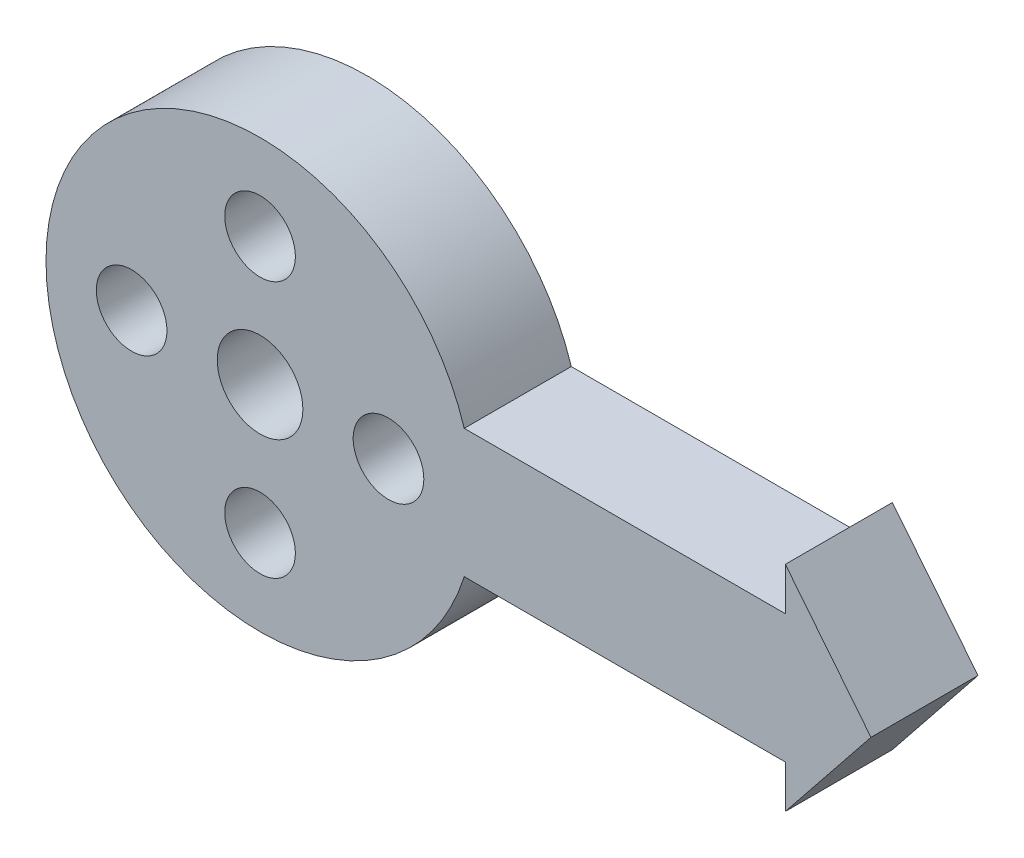
ISO-10303-21;
HEADER;
FILE_DESCRIPTION(('STEP AP214'),'2;1');
FILE_NAME('part.step','',(''),(''),'','','');
FILE_SCHEMA(('AUTOMOTIVE_DESIGN { 1 0 10303 214 1 1 1 1 }'));
ENDSEC;
DATA;
#1=APPLICATION_CONTEXT('core data for automotive mechanical design processes');
#2=APPLICATION_PROTOCOL_DEFINITION('international standard','automotive_design',2000,#1);
#3=PRODUCT_CONTEXT('',#1,'mechanical');
#4=PRODUCT('Part','Part','',(#3));
#5=PRODUCT_RELATED_PRODUCT_CATEGORY('part','',(#4));
#6=PRODUCT_DEFINITION_FORMATION('','',#4);
#7=PRODUCT_DEFINITION_CONTEXT('part definition',#1,'design');
#8=PRODUCT_DEFINITION('design','',#6,#7);
#9=PRODUCT_DEFINITION_SHAPE('','',#8);
#10=(LENGTH_UNIT() NAMED_UNIT(*) SI_UNIT(.MILLI.,.METRE.));
#11=(NAMED_UNIT(*) PLANE_ANGLE_UNIT() SI_UNIT($,.RADIAN.));
#12=(NAMED_UNIT(*) SI_UNIT($,.STERADIAN.) SOLID_ANGLE_UNIT());
#13=UNCERTAINTY_MEASURE_WITH_UNIT(LENGTH_MEASURE(1.E-05),#10,'distance_accuracy_value','');
#14=(GEOMETRIC_REPRESENTATION_CONTEXT(3) GLOBAL_UNCERTAINTY_ASSIGNED_CONTEXT((#13)) GLOBAL_UNIT_ASSIGNED_CONTEXT((#10,
#11,#12)) REPRESENTATION_CONTEXT('',''));
#15=CARTESIAN_POINT('',(0.,0.,0.));
#16=DIRECTION('',(0.,0.,1.));
#17=DIRECTION('',(1.,0.,0.));
#18=AXIS2_PLACEMENT_3D('',#15,#16,#17);
#19=CARTESIAN_POINT('',(0.,0.,5.));
#20=DIRECTION('',(0.,0.,1.));
#21=DIRECTION('',(1.,0.,0.));
#22=AXIS2_PLACEMENT_3D('',#19,#20,#21);
#23=PLANE('',#22);
#24=CARTESIAN_POINT('',(0.,-6.,5.));
#25=DIRECTION('',(0.,0.,1.));
#26=DIRECTION('',(1.,0.,0.));
#27=AXIS2_PLACEMENT_3D('',#24,#25,#26);
#28=CIRCLE('',#27,1.65);
#29=CARTESIAN_POINT('',(1.65,-6.,5.));
#30=VERTEX_POINT('',#29);
#31=EDGE_CURVE('E182',#30,#30,#28,.T.);
#32=ORIENTED_EDGE('',*,*,#31,.F.);
#33=EDGE_LOOP('',(#32));
#34=FACE_BOUND('',#33,.T.);
#35=CARTESIAN_POINT('',(0.,6.,5.));
#36=DIRECTION('',(0.,0.,1.));
#37=DIRECTION('',(1.,0.,0.));
#38=AXIS2_PLACEMENT_3D('',#35,#36,#37);
#39=CIRCLE('',#38,1.65);
#40=CARTESIAN_POINT('',(1.65,6.,5.));
#41=VERTEX_POINT('',#40);
#42=EDGE_CURVE('E170',#41,#41,#39,.T.);
#43=ORIENTED_EDGE('',*,*,#42,.F.);
#44=EDGE_LOOP('',(#43));
#45=FACE_BOUND('',#44,.T.);
#46=DIRECTION('',(-0.624695047554424,0.78086880944303,0.));
#47=VECTOR('',#46,1.);
#48=CARTESIAN_POINT('',(24.5393920141695,5.,5.));
#49=LINE('',#48,#47);
#50=CARTESIAN_POINT('',(28.5393920141695,0.,5.));
#51=VERTEX_POINT('',#50);
#52=CARTESIAN_POINT('',(24.5393920141695,5.,5.));
#53=VERTEX_POINT('',#52);
#54=EDGE_CURVE('E143',#51,#53,#49,.T.);
#55=ORIENTED_EDGE('',*,*,#54,.T.);
#56=DIRECTION('',(0.,-1.,0.));
#57=VECTOR('',#56,1.);
#58=CARTESIAN_POINT('',(24.5393920141695,3.,5.));
#59=LINE('',#58,#57);
#60=CARTESIAN_POINT('',(24.5393920141695,3.,5.));
#61=VERTEX_POINT('',#60);
#62=EDGE_CURVE('E96',#53,#61,#59,.T.);
#63=ORIENTED_EDGE('',*,*,#62,.T.);
#64=DIRECTION('',(-1.,0.,0.));
#65=VECTOR('',#64,1.);
#66=CARTESIAN_POINT('',(9.53939201416946,3.,5.));
#67=LINE('',#66,#65);
#68=CARTESIAN_POINT('',(9.53939201416946,3.,5.));
#69=VERTEX_POINT('',#68);
#70=EDGE_CURVE('E155',#61,#69,#67,.T.);
#71=ORIENTED_EDGE('',*,*,#70,.T.);
#72=CARTESIAN_POINT('',(0.,0.,5.));
#73=DIRECTION('',(0.,0.,1.));
#74=DIRECTION('',(1.,0.,0.));
#75=AXIS2_PLACEMENT_3D('',#72,#73,#74);
#76=CIRCLE('',#75,10.);
#77=CARTESIAN_POINT('',(9.53939201416946,-3.,5.));
#78=VERTEX_POINT('',#77);
#79=EDGE_CURVE('E112',#69,#78,#76,.T.);
#80=ORIENTED_EDGE('',*,*,#79,.T.);
#81=DIRECTION('',(1.,0.,0.));
#82=VECTOR('',#81,1.);
#83=CARTESIAN_POINT('',(24.5393920141695,-3.,5.));
#84=LINE('',#83,#82);
#85=CARTESIAN_POINT('',(24.5393920141695,-3.,5.));
#86=VERTEX_POINT('',#85);
#87=EDGE_CURVE('E106',#78,#86,#84,.T.);
#88=ORIENTED_EDGE('',*,*,#87,.T.);
#89=DIRECTION('',(0.,-1.,0.));
#90=VECTOR('',#89,1.);
#91=CARTESIAN_POINT('',(24.5393920141695,-5.,5.));
#92=LINE('',#91,#90);
#93=CARTESIAN_POINT('',(24.5393920141695,-5.,5.));
#94=VERTEX_POINT('',#93);
#95=EDGE_CURVE('E110',#86,#94,#92,.T.);
#96=ORIENTED_EDGE('',*,*,#95,.T.);
#97=DIRECTION('',(0.624695047554424,0.78086880944303,0.));
#98=VECTOR('',#97,1.);
#99=CARTESIAN_POINT('',(28.5393920141695,0.,5.));
#100=LINE('',#99,#98);
#101=EDGE_CURVE('E56',#94,#51,#100,.T.);
#102=ORIENTED_EDGE('',*,*,#101,.T.);
#103=EDGE_LOOP('',(#55,#63,#71,#80,#88,#96,#102));
#104=FACE_BOUND('',#103,.T.);
#105=CARTESIAN_POINT('',(0.,0.,5.));
#106=DIRECTION('',(0.,0.,1.));
#107=DIRECTION('',(1.,0.,0.));
#108=AXIS2_PLACEMENT_3D('',#105,#106,#107);
#109=CIRCLE('',#108,2.);
#110=CARTESIAN_POINT('',(2.,0.,5.));
#111=VERTEX_POINT('',#110);
#112=EDGE_CURVE('E134',#111,#111,#109,.T.);
#113=ORIENTED_EDGE('',*,*,#112,.F.);
#114=EDGE_LOOP('',(#113));
#115=FACE_BOUND('',#114,.T.);
#116=CARTESIAN_POINT('',(6.,0.,5.));
#117=DIRECTION('',(0.,0.,1.));
#118=DIRECTION('',(1.,0.,0.));
#119=AXIS2_PLACEMENT_3D('',#116,#117,#118);
#120=CIRCLE('',#119,1.65);
#121=CARTESIAN_POINT('',(7.65,0.,5.));
#122=VERTEX_POINT('',#121);
#123=EDGE_CURVE('E176',#122,#122,#120,.T.);
#124=ORIENTED_EDGE('',*,*,#123,.F.);
#125=EDGE_LOOP('',(#124));
#126=FACE_BOUND('',#125,.T.);
#127=CARTESIAN_POINT('',(-6.,0.,5.));
#128=DIRECTION('',(0.,0.,1.));
#129=DIRECTION('',(1.,0.,0.));
#130=AXIS2_PLACEMENT_3D('',#127,#128,#129);
#131=CIRCLE('',#130,1.65);
#132=CARTESIAN_POINT('',(-4.35,0.,5.));
#133=VERTEX_POINT('',#132);
#134=EDGE_CURVE('E188',#133,#133,#131,.T.);
#135=ORIENTED_EDGE('',*,*,#134,.F.);
#136=EDGE_LOOP('',(#135));
#137=FACE_BOUND('',#136,.T.);
#138=ADVANCED_FACE('F39',(#34,#45,#104,#115,#126,#137),#23,.T.);
#139=CARTESIAN_POINT('',(0.,0.,0.));
#140=DIRECTION('',(0.,0.,1.));
#141=DIRECTION('',(1.,0.,0.));
#142=AXIS2_PLACEMENT_3D('',#139,#140,#141);
#143=PLANE('',#142);
#144=DIRECTION('',(-0.624695047554424,0.78086880944303,0.));
#145=VECTOR('',#144,1.);
#146=CARTESIAN_POINT('',(24.5393920141695,5.,0.));
#147=LINE('',#146,#145);
#148=CARTESIAN_POINT('',(28.5393920141695,0.,0.));
#149=VERTEX_POINT('',#148);
#150=CARTESIAN_POINT('',(24.5393920141695,5.,0.));
#151=VERTEX_POINT('',#150);
#152=EDGE_CURVE('E130',#149,#151,#147,.T.);
#153=ORIENTED_EDGE('',*,*,#152,.F.);
#154=DIRECTION('',(0.624695047554424,0.78086880944303,0.));
#155=VECTOR('',#154,1.);
#156=CARTESIAN_POINT('',(28.5393920141695,0.,0.));
#157=LINE('',#156,#155);
#158=CARTESIAN_POINT('',(24.5393920141695,-5.,0.));
#159=VERTEX_POINT('',#158);
#160=EDGE_CURVE('E88',#159,#149,#157,.T.);
#161=ORIENTED_EDGE('',*,*,#160,.F.);
#162=DIRECTION('',(0.,-1.,0.));
#163=VECTOR('',#162,1.);
#164=CARTESIAN_POINT('',(24.5393920141695,-5.,0.));
#165=LINE('',#164,#163);
#166=CARTESIAN_POINT('',(24.5393920141695,-3.,0.));
#167=VERTEX_POINT('',#166);
#168=EDGE_CURVE('E82',#167,#159,#165,.T.);
#169=ORIENTED_EDGE('',*,*,#168,.F.);
#170=DIRECTION('',(1.,0.,0.));
#171=VECTOR('',#170,1.);
#172=CARTESIAN_POINT('',(24.5393920141695,-3.,0.));
#173=LINE('',#172,#171);
#174=CARTESIAN_POINT('',(9.53939201416946,-3.,0.));
#175=VERTEX_POINT('',#174);
#176=EDGE_CURVE('E120',#175,#167,#173,.T.);
#177=ORIENTED_EDGE('',*,*,#176,.F.);
#178=CARTESIAN_POINT('',(0.,0.,0.));
#179=DIRECTION('',(0.,0.,1.));
#180=DIRECTION('',(1.,0.,0.));
#181=AXIS2_PLACEMENT_3D('',#178,#179,#180);
#182=CIRCLE('',#181,10.);
#183=CARTESIAN_POINT('',(9.53939201416946,3.,0.));
#184=VERTEX_POINT('',#183);
#185=EDGE_CURVE('E138',#184,#175,#182,.T.);
#186=ORIENTED_EDGE('',*,*,#185,.F.);
#187=DIRECTION('',(-1.,0.,0.));
#188=VECTOR('',#187,1.);
#189=CARTESIAN_POINT('',(9.53939201416946,3.,0.));
#190=LINE('',#189,#188);
#191=CARTESIAN_POINT('',(24.5393920141695,3.,0.));
#192=VERTEX_POINT('',#191);
#193=EDGE_CURVE('E136',#192,#184,#190,.T.);
#194=ORIENTED_EDGE('',*,*,#193,.F.);
#195=DIRECTION('',(0.,-1.,0.));
#196=VECTOR('',#195,1.);
#197=CARTESIAN_POINT('',(24.5393920141695,3.,0.));
#198=LINE('',#197,#196);
#199=EDGE_CURVE('E133',#151,#192,#198,.T.);
#200=ORIENTED_EDGE('',*,*,#199,.F.);
#201=EDGE_LOOP('',(#153,#161,#169,#177,#186,#194,#200));
#202=FACE_BOUND('',#201,.T.);
#203=CARTESIAN_POINT('',(0.,0.,0.));
#204=DIRECTION('',(0.,0.,1.));
#205=DIRECTION('',(1.,0.,0.));
#206=AXIS2_PLACEMENT_3D('',#203,#204,#205);
#207=CIRCLE('',#206,2.);
#208=CARTESIAN_POINT('',(2.,0.,0.));
#209=VERTEX_POINT('',#208);
#210=EDGE_CURVE('E167',#209,#209,#207,.T.);
#211=ORIENTED_EDGE('',*,*,#210,.T.);
#212=EDGE_LOOP('',(#211));
#213=FACE_BOUND('',#212,.T.);
#214=CARTESIAN_POINT('',(0.,6.,0.));
#215=DIRECTION('',(0.,0.,1.));
#216=DIRECTION('',(1.,0.,0.));
#217=AXIS2_PLACEMENT_3D('',#214,#215,#216);
#218=CIRCLE('',#217,1.65);
#219=CARTESIAN_POINT('',(1.65,6.,0.));
#220=VERTEX_POINT('',#219);
#221=EDGE_CURVE('E173',#220,#220,#218,.T.);
#222=ORIENTED_EDGE('',*,*,#221,.T.);
#223=EDGE_LOOP('',(#222));
#224=FACE_BOUND('',#223,.T.);
#225=CARTESIAN_POINT('',(6.,0.,0.));
#226=DIRECTION('',(0.,0.,1.));
#227=DIRECTION('',(1.,0.,0.));
#228=AXIS2_PLACEMENT_3D('',#225,#226,#227);
#229=CIRCLE('',#228,1.65);
#230=CARTESIAN_POINT('',(7.65,0.,0.));
#231=VERTEX_POINT('',#230);
#232=EDGE_CURVE('E179',#231,#231,#229,.T.);
#233=ORIENTED_EDGE('',*,*,#232,.T.);
#234=EDGE_LOOP('',(#233));
#235=FACE_BOUND('',#234,.T.);
#236=CARTESIAN_POINT('',(0.,-6.,0.));
#237=DIRECTION('',(0.,0.,1.));
#238=DIRECTION('',(1.,0.,0.));
#239=AXIS2_PLACEMENT_3D('',#236,#237,#238);
#240=CIRCLE('',#239,1.65);
#241=CARTESIAN_POINT('',(1.65,-6.,0.));
#242=VERTEX_POINT('',#241);
#243=EDGE_CURVE('E185',#242,#242,#240,.T.);
#244=ORIENTED_EDGE('',*,*,#243,.T.);
#245=EDGE_LOOP('',(#244));
#246=FACE_BOUND('',#245,.T.);
#247=CARTESIAN_POINT('',(-6.,0.,0.));
#248=DIRECTION('',(0.,0.,1.));
#249=DIRECTION('',(1.,0.,0.));
#250=AXIS2_PLACEMENT_3D('',#247,#248,#249);
#251=CIRCLE('',#250,1.65);
#252=CARTESIAN_POINT('',(-4.35,0.,0.));
#253=VERTEX_POINT('',#252);
#254=EDGE_CURVE('E191',#253,#253,#251,.T.);
#255=ORIENTED_EDGE('',*,*,#254,.T.);
#256=EDGE_LOOP('',(#255));
#257=FACE_BOUND('',#256,.T.);
#258=ADVANCED_FACE('F159',(#202,#213,#224,#235,#246,#257),#143,.F.);
#259=CARTESIAN_POINT('',(24.5393920141695,5.,5.));
#260=DIRECTION('',(-0.78086880944303,-0.624695047554424,0.));
#261=DIRECTION('',(0.624695047554424,-0.78086880944303,0.));
#262=AXIS2_PLACEMENT_3D('',#259,#260,#261);
#263=PLANE('',#262);
#264=ORIENTED_EDGE('',*,*,#152,.T.);
#265=DIRECTION('',(0.,0.,-1.));
#266=VECTOR('',#265,1.);
#267=CARTESIAN_POINT('',(24.5393920141695,5.,5.));
#268=LINE('',#267,#266);
#269=EDGE_CURVE('E11',#53,#151,#268,.T.);
#270=ORIENTED_EDGE('',*,*,#269,.F.);
#271=ORIENTED_EDGE('',*,*,#54,.F.);
#272=DIRECTION('',(0.,0.,-1.));
#273=VECTOR('',#272,1.);
#274=CARTESIAN_POINT('',(28.5393920141695,0.,5.));
#275=LINE('',#274,#273);
#276=EDGE_CURVE('E126',#51,#149,#275,.T.);
#277=ORIENTED_EDGE('',*,*,#276,.T.);
#278=EDGE_LOOP('',(#264,#270,#271,#277));
#279=FACE_BOUND('',#278,.T.);
#280=ADVANCED_FACE('F41',(#279),#263,.F.);
#281=CARTESIAN_POINT('',(24.5393920141695,3.,5.));
#282=DIRECTION('',(1.,0.,0.));
#283=DIRECTION('',(0.,0.,-1.));
#284=AXIS2_PLACEMENT_3D('',#281,#282,#283);
#285=PLANE('',#284);
#286=ORIENTED_EDGE('',*,*,#199,.T.);
#287=DIRECTION('',(0.,0.,-1.));
#288=VECTOR('',#287,1.);
#289=CARTESIAN_POINT('',(24.5393920141695,3.,5.));
#290=LINE('',#289,#288);
#291=EDGE_CURVE('E48',#61,#192,#290,.T.);
#292=ORIENTED_EDGE('',*,*,#291,.F.);
#293=ORIENTED_EDGE('',*,*,#62,.F.);
#294=ORIENTED_EDGE('',*,*,#269,.T.);
#295=EDGE_LOOP('',(#286,#292,#293,#294));
#296=FACE_BOUND('',#295,.T.);
#297=ADVANCED_FACE('F223',(#296),#285,.F.);
#298=CARTESIAN_POINT('',(9.53939201416946,3.,5.));
#299=DIRECTION('',(0.,-1.,0.));
#300=DIRECTION('',(0.,0.,-1.));
#301=AXIS2_PLACEMENT_3D('',#298,#299,#300);
#302=PLANE('',#301);
#303=ORIENTED_EDGE('',*,*,#193,.T.);
#304=DIRECTION('',(0.,0.,-1.));
#305=VECTOR('',#304,1.);
#306=CARTESIAN_POINT('',(9.53939201416946,3.,5.));
#307=LINE('',#306,#305);
#308=EDGE_CURVE('E147',#69,#184,#307,.T.);
#309=ORIENTED_EDGE('',*,*,#308,.F.);
#310=ORIENTED_EDGE('',*,*,#70,.F.);
#311=ORIENTED_EDGE('',*,*,#291,.T.);
#312=EDGE_LOOP('',(#303,#309,#310,#311));
#313=FACE_BOUND('',#312,.T.);
#314=ADVANCED_FACE('F153',(#313),#302,.F.);
#315=CARTESIAN_POINT('',(0.,0.,5.));
#316=DIRECTION('',(0.,0.,-1.));
#317=DIRECTION('',(-1.,0.,0.));
#318=AXIS2_PLACEMENT_3D('',#315,#316,#317);
#319=CYLINDRICAL_SURFACE('',#318,10.);
#320=ORIENTED_EDGE('',*,*,#185,.T.);
#321=DIRECTION('',(0.,0.,-1.));
#322=VECTOR('',#321,1.);
#323=CARTESIAN_POINT('',(9.53939201416946,-3.,5.));
#324=LINE('',#323,#322);
#325=EDGE_CURVE('E121',#78,#175,#324,.T.);
#326=ORIENTED_EDGE('',*,*,#325,.F.);
#327=ORIENTED_EDGE('',*,*,#79,.F.);
#328=ORIENTED_EDGE('',*,*,#308,.T.);
#329=EDGE_LOOP('',(#320,#326,#327,#328));
#330=FACE_BOUND('',#329,.T.);
#331=ADVANCED_FACE('F162',(#330),#319,.T.);
#332=CARTESIAN_POINT('',(24.5393920141695,-3.,5.));
#333=DIRECTION('',(0.,1.,0.));
#334=DIRECTION('',(-1.,0.,0.));
#335=AXIS2_PLACEMENT_3D('',#332,#333,#334);
#336=PLANE('',#335);
#337=ORIENTED_EDGE('',*,*,#176,.T.);
#338=DIRECTION('',(0.,0.,-1.));
#339=VECTOR('',#338,1.);
#340=CARTESIAN_POINT('',(24.5393920141695,-3.,5.));
#341=LINE('',#340,#339);
#342=EDGE_CURVE('E117',#86,#167,#341,.T.);
#343=ORIENTED_EDGE('',*,*,#342,.F.);
#344=ORIENTED_EDGE('',*,*,#87,.F.);
#345=ORIENTED_EDGE('',*,*,#325,.T.);
#346=EDGE_LOOP('',(#337,#343,#344,#345));
#347=FACE_BOUND('',#346,.T.);
#348=ADVANCED_FACE('F118',(#347),#336,.F.);
#349=CARTESIAN_POINT('',(24.5393920141695,-5.,5.));
#350=DIRECTION('',(1.,0.,0.));
#351=DIRECTION('',(0.,0.,-1.));
#352=AXIS2_PLACEMENT_3D('',#349,#350,#351);
#353=PLANE('',#352);
#354=ORIENTED_EDGE('',*,*,#168,.T.);
#355=DIRECTION('',(0.,0.,-1.));
#356=VECTOR('',#355,1.);
#357=CARTESIAN_POINT('',(24.5393920141695,-5.,5.));
#358=LINE('',#357,#356);
#359=EDGE_CURVE('E122',#94,#159,#358,.T.);
#360=ORIENTED_EDGE('',*,*,#359,.F.);
#361=ORIENTED_EDGE('',*,*,#95,.F.);
#362=ORIENTED_EDGE('',*,*,#342,.T.);
#363=EDGE_LOOP('',(#354,#360,#361,#362));
#364=FACE_BOUND('',#363,.T.);
#365=ADVANCED_FACE('F124',(#364),#353,.F.);
#366=CARTESIAN_POINT('',(28.5393920141695,0.,5.));
#367=DIRECTION('',(-0.78086880944303,0.624695047554424,0.));
#368=DIRECTION('',(-0.624695047554424,-0.78086880944303,0.));
#369=AXIS2_PLACEMENT_3D('',#366,#367,#368);
#370=PLANE('',#369);
#371=ORIENTED_EDGE('',*,*,#160,.T.);
#372=ORIENTED_EDGE('',*,*,#276,.F.);
#373=ORIENTED_EDGE('',*,*,#101,.F.);
#374=ORIENTED_EDGE('',*,*,#359,.T.);
#375=EDGE_LOOP('',(#371,#372,#373,#374));
#376=FACE_BOUND('',#375,.T.);
#377=ADVANCED_FACE('F213',(#376),#370,.F.);
#378=CARTESIAN_POINT('',(0.,0.,5.));
#379=DIRECTION('',(0.,0.,-1.));
#380=DIRECTION('',(-1.,0.,0.));
#381=AXIS2_PLACEMENT_3D('',#378,#379,#380);
#382=CYLINDRICAL_SURFACE('',#381,2.);
#383=ORIENTED_EDGE('',*,*,#112,.T.);
#384=EDGE_LOOP('',(#383));
#385=FACE_BOUND('',#384,.T.);
#386=ORIENTED_EDGE('',*,*,#210,.F.);
#387=EDGE_LOOP('',(#386));
#388=FACE_BOUND('',#387,.T.);
#389=ADVANCED_FACE('F210',(#385,#388),#382,.F.);
#390=CARTESIAN_POINT('',(0.,6.,5.));
#391=DIRECTION('',(0.,0.,-1.));
#392=DIRECTION('',(-1.,0.,0.));
#393=AXIS2_PLACEMENT_3D('',#390,#391,#392);
#394=CYLINDRICAL_SURFACE('',#393,1.65);
#395=ORIENTED_EDGE('',*,*,#42,.T.);
#396=EDGE_LOOP('',(#395));
#397=FACE_BOUND('',#396,.T.);
#398=ORIENTED_EDGE('',*,*,#221,.F.);
#399=EDGE_LOOP('',(#398));
#400=FACE_BOUND('',#399,.T.);
#401=ADVANCED_FACE('F281',(#397,#400),#394,.F.);
#402=CARTESIAN_POINT('',(6.,0.,5.));
#403=DIRECTION('',(0.,0.,-1.));
#404=DIRECTION('',(-1.,0.,0.));
#405=AXIS2_PLACEMENT_3D('',#402,#403,#404);
#406=CYLINDRICAL_SURFACE('',#405,1.65);
#407=ORIENTED_EDGE('',*,*,#123,.T.);
#408=EDGE_LOOP('',(#407));
#409=FACE_BOUND('',#408,.T.);
#410=ORIENTED_EDGE('',*,*,#232,.F.);
#411=EDGE_LOOP('',(#410));
#412=FACE_BOUND('',#411,.T.);
#413=ADVANCED_FACE('F289',(#409,#412),#406,.F.);
#414=CARTESIAN_POINT('',(0.,-6.,5.));
#415=DIRECTION('',(0.,0.,-1.));
#416=DIRECTION('',(-1.,0.,0.));
#417=AXIS2_PLACEMENT_3D('',#414,#415,#416);
#418=CYLINDRICAL_SURFACE('',#417,1.65);
#419=ORIENTED_EDGE('',*,*,#31,.T.);
#420=EDGE_LOOP('',(#419));
#421=FACE_BOUND('',#420,.T.);
#422=ORIENTED_EDGE('',*,*,#243,.F.);
#423=EDGE_LOOP('',(#422));
#424=FACE_BOUND('',#423,.T.);
#425=ADVANCED_FACE('F297',(#421,#424),#418,.F.);
#426=CARTESIAN_POINT('',(-6.,0.,5.));
#427=DIRECTION('',(0.,0.,-1.));
#428=DIRECTION('',(-1.,0.,0.));
#429=AXIS2_PLACEMENT_3D('',#426,#427,#428);
#430=CYLINDRICAL_SURFACE('',#429,1.65);
#431=ORIENTED_EDGE('',*,*,#134,.T.);
#432=EDGE_LOOP('',(#431));
#433=FACE_BOUND('',#432,.T.);
#434=ORIENTED_EDGE('',*,*,#254,.F.);
#435=EDGE_LOOP('',(#434));
#436=FACE_BOUND('',#435,.T.);
#437=ADVANCED_FACE('F197',(#433,#436),#430,.F.);
#438=CLOSED_SHELL('',(#138,#258,#280,#297,#314,#331,#348,#365,#377,#389,#401,#413,#425,#437));
#439=MANIFOLD_SOLID_BREP('B2',#438);
#440=ADVANCED_BREP_SHAPE_REPRESENTATION('',(#18,#439),#14);
#441=SHAPE_DEFINITION_REPRESENTATION(#9,#440);
ENDSEC;
END-ISO-10303-21;
